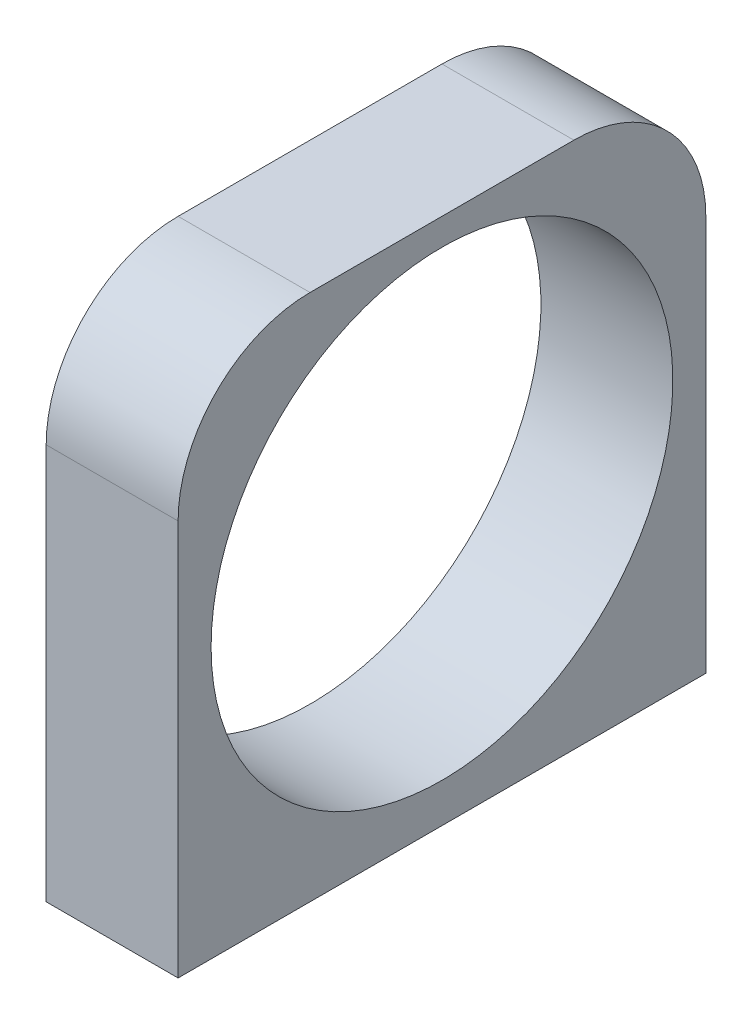
ISO-10303-21;
HEADER;
FILE_DESCRIPTION(('STEP AP214'),'2;1');
FILE_NAME('part.step','',(''),(''),'','','');
FILE_SCHEMA(('AUTOMOTIVE_DESIGN { 1 0 10303 214 1 1 1 1 }'));
ENDSEC;
DATA;
#1=APPLICATION_CONTEXT('core data for automotive mechanical design processes');
#2=APPLICATION_PROTOCOL_DEFINITION('international standard','automotive_design',2000,#1);
#3=PRODUCT_CONTEXT('',#1,'mechanical');
#4=PRODUCT('Part','Part','',(#3));
#5=PRODUCT_RELATED_PRODUCT_CATEGORY('part','',(#4));
#6=PRODUCT_DEFINITION_FORMATION('','',#4);
#7=PRODUCT_DEFINITION_CONTEXT('part definition',#1,'design');
#8=PRODUCT_DEFINITION('design','',#6,#7);
#9=PRODUCT_DEFINITION_SHAPE('','',#8);
#10=(LENGTH_UNIT() NAMED_UNIT(*) SI_UNIT(.MILLI.,.METRE.));
#11=(NAMED_UNIT(*) PLANE_ANGLE_UNIT() SI_UNIT($,.RADIAN.));
#12=(NAMED_UNIT(*) SI_UNIT($,.STERADIAN.) SOLID_ANGLE_UNIT());
#13=UNCERTAINTY_MEASURE_WITH_UNIT(LENGTH_MEASURE(1.E-05),#10,'distance_accuracy_value','');
#14=(GEOMETRIC_REPRESENTATION_CONTEXT(3) GLOBAL_UNCERTAINTY_ASSIGNED_CONTEXT((#13)) GLOBAL_UNIT_ASSIGNED_CONTEXT((#10,
#11,#12)) REPRESENTATION_CONTEXT('',''));
#15=CARTESIAN_POINT('',(0.,0.,0.));
#16=DIRECTION('',(0.,0.,1.));
#17=DIRECTION('',(1.,0.,0.));
#18=AXIS2_PLACEMENT_3D('',#15,#16,#17);
#19=CARTESIAN_POINT('',(3.175,25.4,12.7));
#20=DIRECTION('',(-1.,0.,0.));
#21=DIRECTION('',(0.,0.,1.));
#22=AXIS2_PLACEMENT_3D('',#19,#20,#21);
#23=PLANE('',#22);
#24=CARTESIAN_POINT('',(3.175,13.,0.));
#25=DIRECTION('',(-1.,0.,0.));
#26=DIRECTION('',(0.,0.,1.));
#27=AXIS2_PLACEMENT_3D('',#24,#25,#26);
#28=CIRCLE('',#27,11.1125);
#29=CARTESIAN_POINT('',(3.175,13.,11.1125));
#30=VERTEX_POINT('',#29);
#31=EDGE_CURVE('E108',#30,#30,#28,.T.);
#32=ORIENTED_EDGE('',*,*,#31,.T.);
#33=EDGE_LOOP('',(#32));
#34=FACE_BOUND('',#33,.T.);
#35=DIRECTION('',(0.,-1.,0.));
#36=VECTOR('',#35,1.);
#37=CARTESIAN_POINT('',(3.175,25.4,-12.7));
#38=LINE('',#37,#36);
#39=CARTESIAN_POINT('',(3.175,19.05,-12.7));
#40=VERTEX_POINT('',#39);
#41=CARTESIAN_POINT('',(3.175,0.,-12.7));
#42=VERTEX_POINT('',#41);
#43=EDGE_CURVE('E88',#40,#42,#38,.T.);
#44=ORIENTED_EDGE('',*,*,#43,.F.);
#45=CARTESIAN_POINT('',(3.175,19.05,-6.35));
#46=DIRECTION('',(-1.,0.,0.));
#47=DIRECTION('',(0.,0.,1.));
#48=AXIS2_PLACEMENT_3D('',#45,#46,#47);
#49=CIRCLE('',#48,6.35);
#50=CARTESIAN_POINT('',(3.175,25.4,-6.35));
#51=VERTEX_POINT('',#50);
#52=EDGE_CURVE('E45',#40,#51,#49,.F.);
#53=ORIENTED_EDGE('',*,*,#52,.T.);
#54=DIRECTION('',(0.,0.,-1.));
#55=VECTOR('',#54,1.);
#56=CARTESIAN_POINT('',(3.175,25.4,12.7));
#57=LINE('',#56,#55);
#58=CARTESIAN_POINT('',(3.175,25.4,6.35));
#59=VERTEX_POINT('',#58);
#60=EDGE_CURVE('E120',#59,#51,#57,.T.);
#61=ORIENTED_EDGE('',*,*,#60,.F.);
#62=CARTESIAN_POINT('',(3.175,19.05,6.35));
#63=DIRECTION('',(-1.,0.,0.));
#64=DIRECTION('',(0.,0.,1.));
#65=AXIS2_PLACEMENT_3D('',#62,#63,#64);
#66=CIRCLE('',#65,6.35);
#67=CARTESIAN_POINT('',(3.175,19.05,12.7));
#68=VERTEX_POINT('',#67);
#69=EDGE_CURVE('E52',#59,#68,#66,.F.);
#70=ORIENTED_EDGE('',*,*,#69,.T.);
#71=DIRECTION('',(0.,-1.,0.));
#72=VECTOR('',#71,1.);
#73=CARTESIAN_POINT('',(3.175,25.4,12.7));
#74=LINE('',#73,#72);
#75=CARTESIAN_POINT('',(3.175,0.,12.7));
#76=VERTEX_POINT('',#75);
#77=EDGE_CURVE('E106',#68,#76,#74,.T.);
#78=ORIENTED_EDGE('',*,*,#77,.T.);
#79=DIRECTION('',(0.,0.,-1.));
#80=VECTOR('',#79,1.);
#81=CARTESIAN_POINT('',(3.175,0.,12.7));
#82=LINE('',#81,#80);
#83=EDGE_CURVE('E102',#76,#42,#82,.T.);
#84=ORIENTED_EDGE('',*,*,#83,.T.);
#85=EDGE_LOOP('',(#44,#53,#61,#70,#78,#84));
#86=FACE_BOUND('',#85,.T.);
#87=ADVANCED_FACE('F37',(#34,#86),#23,.F.);
#88=CARTESIAN_POINT('',(-3.175,25.4,-12.7));
#89=DIRECTION('',(0.,0.,1.));
#90=DIRECTION('',(1.,0.,0.));
#91=AXIS2_PLACEMENT_3D('',#88,#89,#90);
#92=PLANE('',#91);
#93=DIRECTION('',(0.,-1.,0.));
#94=VECTOR('',#93,1.);
#95=CARTESIAN_POINT('',(-3.175,25.4,-12.7));
#96=LINE('',#95,#94);
#97=CARTESIAN_POINT('',(-3.175,19.05,-12.7));
#98=VERTEX_POINT('',#97);
#99=CARTESIAN_POINT('',(-3.175,0.,-12.7));
#100=VERTEX_POINT('',#99);
#101=EDGE_CURVE('E96',#98,#100,#96,.T.);
#102=ORIENTED_EDGE('',*,*,#101,.F.);
#103=DIRECTION('',(-1.,0.,0.));
#104=VECTOR('',#103,1.);
#105=CARTESIAN_POINT('',(-3.175,19.05,-12.7));
#106=LINE('',#105,#104);
#107=EDGE_CURVE('E60',#98,#40,#106,.F.);
#108=ORIENTED_EDGE('',*,*,#107,.T.);
#109=ORIENTED_EDGE('',*,*,#43,.T.);
#110=DIRECTION('',(-1.,0.,0.));
#111=VECTOR('',#110,1.);
#112=CARTESIAN_POINT('',(-3.175,0.,-12.7));
#113=LINE('',#112,#111);
#114=EDGE_CURVE('E91',#42,#100,#113,.T.);
#115=ORIENTED_EDGE('',*,*,#114,.T.);
#116=EDGE_LOOP('',(#102,#108,#109,#115));
#117=FACE_BOUND('',#116,.T.);
#118=ADVANCED_FACE('F90',(#117),#92,.F.);
#119=CARTESIAN_POINT('',(-3.175,25.4,12.7));
#120=DIRECTION('',(1.,0.,0.));
#121=DIRECTION('',(0.,0.,-1.));
#122=AXIS2_PLACEMENT_3D('',#119,#120,#121);
#123=PLANE('',#122);
#124=CARTESIAN_POINT('',(-3.175,13.,0.));
#125=DIRECTION('',(-1.,0.,0.));
#126=DIRECTION('',(0.,0.,1.));
#127=AXIS2_PLACEMENT_3D('',#124,#125,#126);
#128=CIRCLE('',#127,11.1125);
#129=CARTESIAN_POINT('',(-3.175,13.,11.1125));
#130=VERTEX_POINT('',#129);
#131=EDGE_CURVE('E111',#130,#130,#128,.T.);
#132=ORIENTED_EDGE('',*,*,#131,.F.);
#133=EDGE_LOOP('',(#132));
#134=FACE_BOUND('',#133,.T.);
#135=DIRECTION('',(0.,0.,1.));
#136=VECTOR('',#135,1.);
#137=CARTESIAN_POINT('',(-3.175,25.4,12.7));
#138=LINE('',#137,#136);
#139=CARTESIAN_POINT('',(-3.175,25.4,-6.35));
#140=VERTEX_POINT('',#139);
#141=CARTESIAN_POINT('',(-3.175,25.4,6.35));
#142=VERTEX_POINT('',#141);
#143=EDGE_CURVE('E114',#140,#142,#138,.T.);
#144=ORIENTED_EDGE('',*,*,#143,.F.);
#145=CARTESIAN_POINT('',(-3.175,19.05,-6.35));
#146=DIRECTION('',(1.,0.,0.));
#147=DIRECTION('',(0.,0.,-1.));
#148=AXIS2_PLACEMENT_3D('',#145,#146,#147);
#149=CIRCLE('',#148,6.35);
#150=EDGE_CURVE('E132',#140,#98,#149,.F.);
#151=ORIENTED_EDGE('',*,*,#150,.T.);
#152=ORIENTED_EDGE('',*,*,#101,.T.);
#153=DIRECTION('',(0.,0.,1.));
#154=VECTOR('',#153,1.);
#155=CARTESIAN_POINT('',(-3.175,0.,12.7));
#156=LINE('',#155,#154);
#157=CARTESIAN_POINT('',(-3.175,0.,12.7));
#158=VERTEX_POINT('',#157);
#159=EDGE_CURVE('E104',#100,#158,#156,.T.);
#160=ORIENTED_EDGE('',*,*,#159,.T.);
#161=DIRECTION('',(0.,-1.,0.));
#162=VECTOR('',#161,1.);
#163=CARTESIAN_POINT('',(-3.175,25.4,12.7));
#164=LINE('',#163,#162);
#165=CARTESIAN_POINT('',(-3.175,19.05,12.7));
#166=VERTEX_POINT('',#165);
#167=EDGE_CURVE('E122',#166,#158,#164,.T.);
#168=ORIENTED_EDGE('',*,*,#167,.F.);
#169=CARTESIAN_POINT('',(-3.175,19.05,6.35));
#170=DIRECTION('',(1.,0.,0.));
#171=DIRECTION('',(0.,0.,-1.));
#172=AXIS2_PLACEMENT_3D('',#169,#170,#171);
#173=CIRCLE('',#172,6.35);
#174=EDGE_CURVE('E130',#166,#142,#173,.F.);
#175=ORIENTED_EDGE('',*,*,#174,.T.);
#176=EDGE_LOOP('',(#144,#151,#152,#160,#168,#175));
#177=FACE_BOUND('',#176,.T.);
#178=ADVANCED_FACE('F145',(#134,#177),#123,.F.);
#179=CARTESIAN_POINT('',(-3.175,25.4,12.7));
#180=DIRECTION('',(0.,0.,-1.));
#181=DIRECTION('',(-1.,0.,0.));
#182=AXIS2_PLACEMENT_3D('',#179,#180,#181);
#183=PLANE('',#182);
#184=ORIENTED_EDGE('',*,*,#77,.F.);
#185=DIRECTION('',(1.,0.,0.));
#186=VECTOR('',#185,1.);
#187=CARTESIAN_POINT('',(-3.175,19.05,12.7));
#188=LINE('',#187,#186);
#189=EDGE_CURVE('E11',#68,#166,#188,.F.);
#190=ORIENTED_EDGE('',*,*,#189,.T.);
#191=ORIENTED_EDGE('',*,*,#167,.T.);
#192=DIRECTION('',(1.,0.,0.));
#193=VECTOR('',#192,1.);
#194=CARTESIAN_POINT('',(-3.175,0.,12.7));
#195=LINE('',#194,#193);
#196=EDGE_CURVE('E118',#158,#76,#195,.T.);
#197=ORIENTED_EDGE('',*,*,#196,.T.);
#198=EDGE_LOOP('',(#184,#190,#191,#197));
#199=FACE_BOUND('',#198,.T.);
#200=ADVANCED_FACE('F151',(#199),#183,.F.);
#201=CARTESIAN_POINT('',(0.,25.4,0.));
#202=DIRECTION('',(0.,-1.,0.));
#203=DIRECTION('',(0.,0.,-1.));
#204=AXIS2_PLACEMENT_3D('',#201,#202,#203);
#205=PLANE('',#204);
#206=ORIENTED_EDGE('',*,*,#60,.T.);
#207=DIRECTION('',(-1.,0.,0.));
#208=VECTOR('',#207,1.);
#209=CARTESIAN_POINT('',(0.,25.4,-6.35));
#210=LINE('',#209,#208);
#211=EDGE_CURVE('E127',#51,#140,#210,.T.);
#212=ORIENTED_EDGE('',*,*,#211,.T.);
#213=ORIENTED_EDGE('',*,*,#143,.T.);
#214=DIRECTION('',(1.,0.,0.));
#215=VECTOR('',#214,1.);
#216=CARTESIAN_POINT('',(0.,25.4,6.35));
#217=LINE('',#216,#215);
#218=EDGE_CURVE('E95',#142,#59,#217,.T.);
#219=ORIENTED_EDGE('',*,*,#218,.T.);
#220=EDGE_LOOP('',(#206,#212,#213,#219));
#221=FACE_BOUND('',#220,.T.);
#222=ADVANCED_FACE('F139',(#221),#205,.F.);
#223=CARTESIAN_POINT('',(0.,0.,0.));
#224=DIRECTION('',(0.,-1.,0.));
#225=DIRECTION('',(0.,0.,-1.));
#226=AXIS2_PLACEMENT_3D('',#223,#224,#225);
#227=PLANE('',#226);
#228=ORIENTED_EDGE('',*,*,#83,.F.);
#229=ORIENTED_EDGE('',*,*,#196,.F.);
#230=ORIENTED_EDGE('',*,*,#159,.F.);
#231=ORIENTED_EDGE('',*,*,#114,.F.);
#232=EDGE_LOOP('',(#228,#229,#230,#231));
#233=FACE_BOUND('',#232,.T.);
#234=ADVANCED_FACE('F100',(#233),#227,.T.);
#235=CARTESIAN_POINT('',(0.,19.05,-6.35));
#236=DIRECTION('',(-1.,0.,0.));
#237=DIRECTION('',(0.,0.,1.));
#238=AXIS2_PLACEMENT_3D('',#235,#236,#237);
#239=CYLINDRICAL_SURFACE('',#238,6.35);
#240=ORIENTED_EDGE('',*,*,#52,.F.);
#241=ORIENTED_EDGE('',*,*,#107,.F.);
#242=ORIENTED_EDGE('',*,*,#150,.F.);
#243=ORIENTED_EDGE('',*,*,#211,.F.);
#244=EDGE_LOOP('',(#240,#241,#242,#243));
#245=FACE_BOUND('',#244,.T.);
#246=ADVANCED_FACE('F143',(#245),#239,.T.);
#247=CARTESIAN_POINT('',(0.,19.05,6.35));
#248=DIRECTION('',(1.,0.,0.));
#249=DIRECTION('',(0.,0.,-1.));
#250=AXIS2_PLACEMENT_3D('',#247,#248,#249);
#251=CYLINDRICAL_SURFACE('',#250,6.35);
#252=ORIENTED_EDGE('',*,*,#174,.F.);
#253=ORIENTED_EDGE('',*,*,#189,.F.);
#254=ORIENTED_EDGE('',*,*,#69,.F.);
#255=ORIENTED_EDGE('',*,*,#218,.F.);
#256=EDGE_LOOP('',(#252,#253,#254,#255));
#257=FACE_BOUND('',#256,.T.);
#258=ADVANCED_FACE('F39',(#257),#251,.T.);
#259=CARTESIAN_POINT('',(3.175,13.,0.));
#260=DIRECTION('',(-1.,0.,0.));
#261=DIRECTION('',(0.,0.,1.));
#262=AXIS2_PLACEMENT_3D('',#259,#260,#261);
#263=CYLINDRICAL_SURFACE('',#262,11.1125);
#264=ORIENTED_EDGE('',*,*,#31,.F.);
#265=EDGE_LOOP('',(#264));
#266=FACE_BOUND('',#265,.T.);
#267=ORIENTED_EDGE('',*,*,#131,.T.);
#268=EDGE_LOOP('',(#267));
#269=FACE_BOUND('',#268,.T.);
#270=ADVANCED_FACE('F174',(#266,#269),#263,.F.);
#271=CLOSED_SHELL('',(#87,#118,#178,#200,#222,#234,#246,#258,#270));
#272=MANIFOLD_SOLID_BREP('B2',#271);
#273=ADVANCED_BREP_SHAPE_REPRESENTATION('',(#18,#272),#14);
#274=SHAPE_DEFINITION_REPRESENTATION(#9,#273);
ENDSEC;
END-ISO-10303-21;
